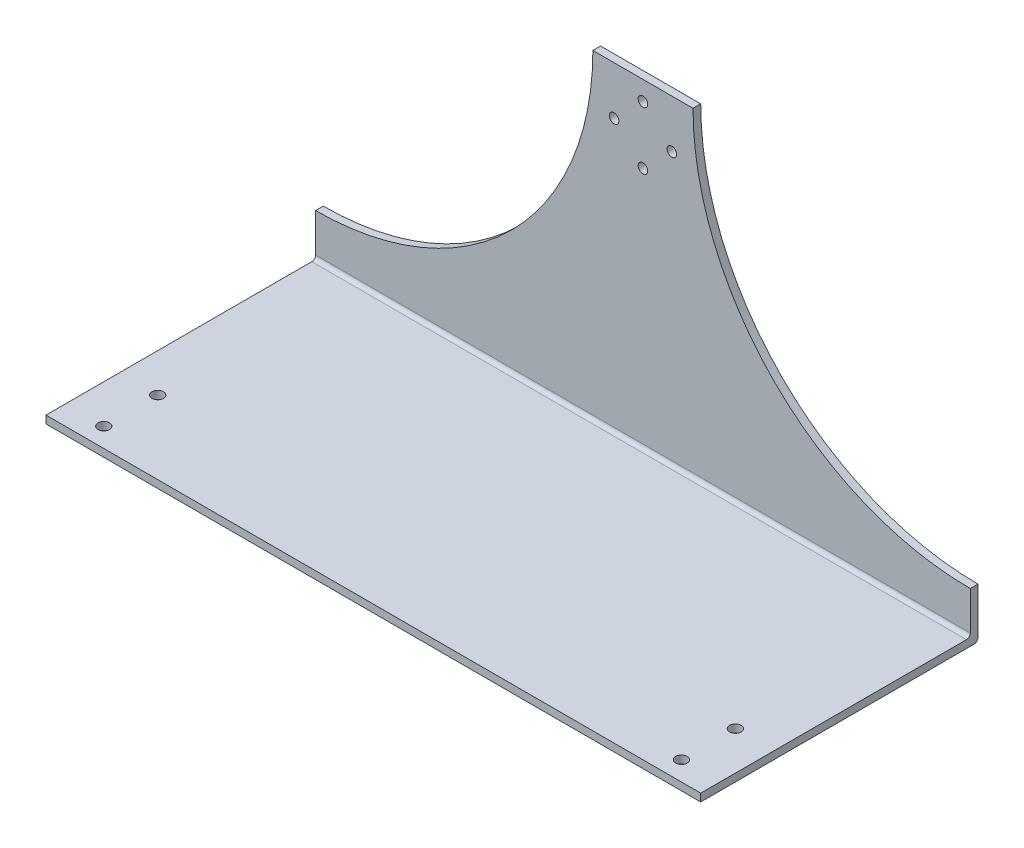
ISO-10303-21;
HEADER;
FILE_DESCRIPTION(('STEP AP214'),'2;1');
FILE_NAME('part.step','',(''),(''),'','','');
FILE_SCHEMA(('AUTOMOTIVE_DESIGN { 1 0 10303 214 1 1 1 1 }'));
ENDSEC;
DATA;
#1=APPLICATION_CONTEXT('core data for automotive mechanical design processes');
#2=APPLICATION_PROTOCOL_DEFINITION('international standard','automotive_design',2000,#1);
#3=PRODUCT_CONTEXT('',#1,'mechanical');
#4=PRODUCT('Part','Part','',(#3));
#5=PRODUCT_RELATED_PRODUCT_CATEGORY('part','',(#4));
#6=PRODUCT_DEFINITION_FORMATION('','',#4);
#7=PRODUCT_DEFINITION_CONTEXT('part definition',#1,'design');
#8=PRODUCT_DEFINITION('design','',#6,#7);
#9=PRODUCT_DEFINITION_SHAPE('','',#8);
#10=(LENGTH_UNIT() NAMED_UNIT(*) SI_UNIT(.MILLI.,.METRE.));
#11=(NAMED_UNIT(*) PLANE_ANGLE_UNIT() SI_UNIT($,.RADIAN.));
#12=(NAMED_UNIT(*) SI_UNIT($,.STERADIAN.) SOLID_ANGLE_UNIT());
#13=UNCERTAINTY_MEASURE_WITH_UNIT(LENGTH_MEASURE(1.E-05),#10,'distance_accuracy_value','');
#14=(GEOMETRIC_REPRESENTATION_CONTEXT(3) GLOBAL_UNCERTAINTY_ASSIGNED_CONTEXT((#13)) GLOBAL_UNIT_ASSIGNED_CONTEXT((#10,
#11,#12)) REPRESENTATION_CONTEXT('',''));
#15=CARTESIAN_POINT('',(0.,0.,0.));
#16=DIRECTION('',(0.,0.,1.));
#17=DIRECTION('',(1.,0.,0.));
#18=AXIS2_PLACEMENT_3D('',#15,#16,#17);
#19=CARTESIAN_POINT('',(0.,0.,1.21678982349346));
#20=DIRECTION('',(0.,0.,1.));
#21=DIRECTION('',(1.,0.,0.));
#22=AXIS2_PLACEMENT_3D('',#19,#20,#21);
#23=PLANE('',#22);
#24=CARTESIAN_POINT('',(6.94229860509075,72.5,1.21678982349346));
#25=DIRECTION('',(0.,0.,1.));
#26=DIRECTION('',(1.,0.,0.));
#27=AXIS2_PLACEMENT_3D('',#24,#25,#26);
#28=CIRCLE('',#27,1.25);
#29=CARTESIAN_POINT('',(8.19229860509076,72.5,1.21678982349346));
#30=VERTEX_POINT('',#29);
#31=EDGE_CURVE('E217',#30,#30,#28,.F.);
#32=ORIENTED_EDGE('',*,*,#31,.T.);
#33=EDGE_LOOP('',(#32));
#34=FACE_BOUND('',#33,.T.);
#35=CARTESIAN_POINT('',(-0.557701394909238,80.,1.21678982349346));
#36=DIRECTION('',(0.,0.,1.));
#37=DIRECTION('',(1.,0.,0.));
#38=AXIS2_PLACEMENT_3D('',#35,#36,#37);
#39=CIRCLE('',#38,1.25);
#40=CARTESIAN_POINT('',(0.692298605090763,80.,1.21678982349346));
#41=VERTEX_POINT('',#40);
#42=EDGE_CURVE('E132',#41,#41,#39,.F.);
#43=ORIENTED_EDGE('',*,*,#42,.T.);
#44=EDGE_LOOP('',(#43));
#45=FACE_BOUND('',#44,.T.);
#46=CARTESIAN_POINT('',(-0.557701394909238,65.,1.21678982349346));
#47=DIRECTION('',(0.,0.,1.));
#48=DIRECTION('',(1.,0.,0.));
#49=AXIS2_PLACEMENT_3D('',#46,#47,#48);
#50=CIRCLE('',#49,1.25);
#51=CARTESIAN_POINT('',(0.692298605090763,65.,1.21678982349346));
#52=VERTEX_POINT('',#51);
#53=EDGE_CURVE('E213',#52,#52,#50,.F.);
#54=ORIENTED_EDGE('',*,*,#53,.T.);
#55=EDGE_LOOP('',(#54));
#56=FACE_BOUND('',#55,.T.);
#57=CARTESIAN_POINT('',(-8.05770139490924,72.5,1.21678982349346));
#58=DIRECTION('',(0.,0.,1.));
#59=DIRECTION('',(1.,0.,0.));
#60=AXIS2_PLACEMENT_3D('',#57,#58,#59);
#61=CIRCLE('',#60,1.25);
#62=CARTESIAN_POINT('',(-6.80770139490924,72.5,1.21678982349346));
#63=VERTEX_POINT('',#62);
#64=EDGE_CURVE('E221',#63,#63,#61,.F.);
#65=ORIENTED_EDGE('',*,*,#64,.T.);
#66=EDGE_LOOP('',(#65));
#67=FACE_BOUND('',#66,.T.);
#68=DIRECTION('',(1.,0.,0.));
#69=VECTOR('',#68,1.);
#70=CARTESIAN_POINT('',(84.4422986050908,85.,1.21678982349346));
#71=LINE('',#70,#69);
#72=CARTESIAN_POINT('',(-13.5577013949092,85.,1.21678982349346));
#73=VERTEX_POINT('',#72);
#74=CARTESIAN_POINT('',(12.4422986050907,85.,1.21678982349346));
#75=VERTEX_POINT('',#74);
#76=EDGE_CURVE('E122',#73,#75,#71,.T.);
#77=ORIENTED_EDGE('',*,*,#76,.F.);
#78=CARTESIAN_POINT('',(-85.5577013949092,85.,1.21678982349346));
#79=DIRECTION('',(0.,0.,1.));
#80=DIRECTION('',(1.,0.,0.));
#81=AXIS2_PLACEMENT_3D('',#78,#79,#80);
#82=CIRCLE('',#81,72.);
#83=CARTESIAN_POINT('',(-85.5577013949092,13.,1.21678982349346));
#84=VERTEX_POINT('',#83);
#85=EDGE_CURVE('E109',#73,#84,#82,.F.);
#86=ORIENTED_EDGE('',*,*,#85,.T.);
#87=DIRECTION('',(0.,1.,0.));
#88=VECTOR('',#87,1.);
#89=CARTESIAN_POINT('',(-85.5577013949092,0.,1.21678982349346));
#90=LINE('',#89,#88);
#91=CARTESIAN_POINT('',(-85.5577013949092,3.,1.21678982349346));
#92=VERTEX_POINT('',#91);
#93=EDGE_CURVE('E119',#92,#84,#90,.T.);
#94=ORIENTED_EDGE('',*,*,#93,.F.);
#95=DIRECTION('',(-1.,0.,0.));
#96=VECTOR('',#95,1.);
#97=CARTESIAN_POINT('',(84.4422986050908,3.,1.21678982349346));
#98=LINE('',#97,#96);
#99=CARTESIAN_POINT('',(84.4422986050908,3.,1.21678982349346));
#100=VERTEX_POINT('',#99);
#101=EDGE_CURVE('E138',#92,#100,#98,.F.);
#102=ORIENTED_EDGE('',*,*,#101,.T.);
#103=DIRECTION('',(0.,-1.,0.));
#104=VECTOR('',#103,1.);
#105=CARTESIAN_POINT('',(84.4422986050908,0.,1.21678982349346));
#106=LINE('',#105,#104);
#107=CARTESIAN_POINT('',(84.4422986050908,13.,1.21678982349346));
#108=VERTEX_POINT('',#107);
#109=EDGE_CURVE('E128',#108,#100,#106,.T.);
#110=ORIENTED_EDGE('',*,*,#109,.F.);
#111=CARTESIAN_POINT('',(84.4422986050908,85.,1.21678982349346));
#112=DIRECTION('',(0.,0.,1.));
#113=DIRECTION('',(1.,0.,0.));
#114=AXIS2_PLACEMENT_3D('',#111,#112,#113);
#115=CIRCLE('',#114,72.0000000000001);
#116=EDGE_CURVE('E227',#108,#75,#115,.F.);
#117=ORIENTED_EDGE('',*,*,#116,.T.);
#118=EDGE_LOOP('',(#77,#86,#94,#102,#110,#117));
#119=FACE_BOUND('',#118,.T.);
#120=ADVANCED_FACE('F33',(#34,#45,#56,#67,#119),#23,.T.);
#121=CARTESIAN_POINT('',(0.,0.,-0.783210176506536));
#122=DIRECTION('',(0.,0.,1.));
#123=DIRECTION('',(1.,0.,0.));
#124=AXIS2_PLACEMENT_3D('',#121,#122,#123);
#125=PLANE('',#124);
#126=CARTESIAN_POINT('',(6.94229860509075,72.5,-0.783210176506536));
#127=DIRECTION('',(0.,0.,1.));
#128=DIRECTION('',(1.,0.,0.));
#129=AXIS2_PLACEMENT_3D('',#126,#127,#128);
#130=CIRCLE('',#129,1.25);
#131=CARTESIAN_POINT('',(8.19229860509076,72.5,-0.783210176506536));
#132=VERTEX_POINT('',#131);
#133=EDGE_CURVE('E220',#132,#132,#130,.F.);
#134=ORIENTED_EDGE('',*,*,#133,.F.);
#135=EDGE_LOOP('',(#134));
#136=FACE_BOUND('',#135,.T.);
#137=CARTESIAN_POINT('',(-0.557701394909238,80.,-0.783210176506536));
#138=DIRECTION('',(0.,0.,1.));
#139=DIRECTION('',(1.,0.,0.));
#140=AXIS2_PLACEMENT_3D('',#137,#138,#139);
#141=CIRCLE('',#140,1.25);
#142=CARTESIAN_POINT('',(0.692298605090763,80.,-0.783210176506536));
#143=VERTEX_POINT('',#142);
#144=EDGE_CURVE('E212',#143,#143,#141,.F.);
#145=ORIENTED_EDGE('',*,*,#144,.F.);
#146=EDGE_LOOP('',(#145));
#147=FACE_BOUND('',#146,.T.);
#148=CARTESIAN_POINT('',(-0.557701394909238,65.,-0.783210176506536));
#149=DIRECTION('',(0.,0.,1.));
#150=DIRECTION('',(1.,0.,0.));
#151=AXIS2_PLACEMENT_3D('',#148,#149,#150);
#152=CIRCLE('',#151,1.25);
#153=CARTESIAN_POINT('',(0.692298605090763,65.,-0.783210176506536));
#154=VERTEX_POINT('',#153);
#155=EDGE_CURVE('E216',#154,#154,#152,.F.);
#156=ORIENTED_EDGE('',*,*,#155,.F.);
#157=EDGE_LOOP('',(#156));
#158=FACE_BOUND('',#157,.T.);
#159=CARTESIAN_POINT('',(-8.05770139490924,72.5,-0.783210176506536));
#160=DIRECTION('',(0.,0.,1.));
#161=DIRECTION('',(1.,0.,0.));
#162=AXIS2_PLACEMENT_3D('',#159,#160,#161);
#163=CIRCLE('',#162,1.25);
#164=CARTESIAN_POINT('',(-6.80770139490924,72.5,-0.783210176506536));
#165=VERTEX_POINT('',#164);
#166=EDGE_CURVE('E224',#165,#165,#163,.F.);
#167=ORIENTED_EDGE('',*,*,#166,.F.);
#168=EDGE_LOOP('',(#167));
#169=FACE_BOUND('',#168,.T.);
#170=CARTESIAN_POINT('',(-85.5577013949092,85.,-0.783210176506536));
#171=DIRECTION('',(0.,0.,1.));
#172=DIRECTION('',(1.,0.,0.));
#173=AXIS2_PLACEMENT_3D('',#170,#171,#172);
#174=CIRCLE('',#173,72.);
#175=CARTESIAN_POINT('',(-13.5577013949092,85.,-0.783210176506536));
#176=VERTEX_POINT('',#175);
#177=CARTESIAN_POINT('',(-85.5577013949092,13.,-0.783210176506536));
#178=VERTEX_POINT('',#177);
#179=EDGE_CURVE('E47',#176,#178,#174,.F.);
#180=ORIENTED_EDGE('',*,*,#179,.F.);
#181=DIRECTION('',(1.,0.,0.));
#182=VECTOR('',#181,1.);
#183=CARTESIAN_POINT('',(84.4422986050908,85.,-0.783210176506536));
#184=LINE('',#183,#182);
#185=CARTESIAN_POINT('',(12.4422986050907,85.,-0.783210176506536));
#186=VERTEX_POINT('',#185);
#187=EDGE_CURVE('E54',#176,#186,#184,.T.);
#188=ORIENTED_EDGE('',*,*,#187,.T.);
#189=CARTESIAN_POINT('',(84.4422986050908,85.,-0.783210176506536));
#190=DIRECTION('',(0.,0.,1.));
#191=DIRECTION('',(1.,0.,0.));
#192=AXIS2_PLACEMENT_3D('',#189,#190,#191);
#193=CIRCLE('',#192,72.0000000000001);
#194=CARTESIAN_POINT('',(84.4422986050908,13.,-0.783210176506536));
#195=VERTEX_POINT('',#194);
#196=EDGE_CURVE('E229',#195,#186,#193,.F.);
#197=ORIENTED_EDGE('',*,*,#196,.F.);
#198=DIRECTION('',(0.,-1.,0.));
#199=VECTOR('',#198,1.);
#200=CARTESIAN_POINT('',(84.4422986050908,0.,-0.783210176506536));
#201=LINE('',#200,#199);
#202=CARTESIAN_POINT('',(84.4422986050908,1.,-0.783210176506536));
#203=VERTEX_POINT('',#202);
#204=EDGE_CURVE('E130',#195,#203,#201,.T.);
#205=ORIENTED_EDGE('',*,*,#204,.T.);
#206=DIRECTION('',(-1.,0.,0.));
#207=VECTOR('',#206,1.);
#208=CARTESIAN_POINT('',(0.,1.,-0.783210176506536));
#209=LINE('',#208,#207);
#210=CARTESIAN_POINT('',(-85.5577013949092,1.,-0.783210176506536));
#211=VERTEX_POINT('',#210);
#212=EDGE_CURVE('E178',#203,#211,#209,.T.);
#213=ORIENTED_EDGE('',*,*,#212,.T.);
#214=DIRECTION('',(0.,1.,0.));
#215=VECTOR('',#214,1.);
#216=CARTESIAN_POINT('',(-85.5577013949092,0.,-0.783210176506536));
#217=LINE('',#216,#215);
#218=EDGE_CURVE('E202',#211,#178,#217,.T.);
#219=ORIENTED_EDGE('',*,*,#218,.T.);
#220=EDGE_LOOP('',(#180,#188,#197,#205,#213,#219));
#221=FACE_BOUND('',#220,.T.);
#222=ADVANCED_FACE('F201',(#136,#147,#158,#169,#221),#125,.F.);
#223=CARTESIAN_POINT('',(84.4422986050908,85.,-0.783210176506536));
#224=DIRECTION('',(0.,-1.,0.));
#225=DIRECTION('',(0.,0.,-1.));
#226=AXIS2_PLACEMENT_3D('',#223,#224,#225);
#227=PLANE('',#226);
#228=DIRECTION('',(0.,0.,-1.));
#229=VECTOR('',#228,1.);
#230=CARTESIAN_POINT('',(-13.5577013949092,85.,13.2167898234935));
#231=LINE('',#230,#229);
#232=EDGE_CURVE('E123',#73,#176,#231,.T.);
#233=ORIENTED_EDGE('',*,*,#232,.F.);
#234=ORIENTED_EDGE('',*,*,#76,.T.);
#235=DIRECTION('',(0.,0.,-1.));
#236=VECTOR('',#235,1.);
#237=CARTESIAN_POINT('',(12.4422986050907,85.,13.2167898234935));
#238=LINE('',#237,#236);
#239=EDGE_CURVE('E41',#186,#75,#238,.F.);
#240=ORIENTED_EDGE('',*,*,#239,.F.);
#241=ORIENTED_EDGE('',*,*,#187,.F.);
#242=EDGE_LOOP('',(#233,#234,#240,#241));
#243=FACE_BOUND('',#242,.T.);
#244=ADVANCED_FACE('F234',(#243),#227,.F.);
#245=CARTESIAN_POINT('',(-85.5577013949092,2.,1.21678982349346));
#246=DIRECTION('',(1.,0.,0.));
#247=DIRECTION('',(0.,0.,-1.));
#248=AXIS2_PLACEMENT_3D('',#245,#246,#247);
#249=PLANE('',#248);
#250=DIRECTION('',(0.,0.,-1.));
#251=VECTOR('',#250,1.);
#252=CARTESIAN_POINT('',(-85.5577013949092,13.,13.2167898234935));
#253=LINE('',#252,#251);
#254=EDGE_CURVE('E11',#178,#84,#253,.F.);
#255=ORIENTED_EDGE('',*,*,#254,.F.);
#256=ORIENTED_EDGE('',*,*,#218,.F.);
#257=CARTESIAN_POINT('',(-85.5577013949092,1.,0.216789823493464));
#258=DIRECTION('',(1.,0.,0.));
#259=DIRECTION('',(0.,0.,-1.));
#260=AXIS2_PLACEMENT_3D('',#257,#258,#259);
#261=CIRCLE('',#260,1.);
#262=CARTESIAN_POINT('',(-85.5577013949092,0.,0.216789823493464));
#263=VERTEX_POINT('',#262);
#264=EDGE_CURVE('E196',#211,#263,#261,.F.);
#265=ORIENTED_EDGE('',*,*,#264,.T.);
#266=DIRECTION('',(0.,0.,1.));
#267=VECTOR('',#266,1.);
#268=CARTESIAN_POINT('',(-85.5577013949092,0.,1.21678982349346));
#269=LINE('',#268,#267);
#270=CARTESIAN_POINT('',(-85.5577013949092,0.,71.2167898234935));
#271=VERTEX_POINT('',#270);
#272=EDGE_CURVE('E161',#263,#271,#269,.T.);
#273=ORIENTED_EDGE('',*,*,#272,.T.);
#274=DIRECTION('',(0.,-1.,0.));
#275=VECTOR('',#274,1.);
#276=CARTESIAN_POINT('',(-85.5577013949092,2.,71.2167898234935));
#277=LINE('',#276,#275);
#278=CARTESIAN_POINT('',(-85.5577013949092,2.,71.2167898234935));
#279=VERTEX_POINT('',#278);
#280=EDGE_CURVE('E175',#279,#271,#277,.T.);
#281=ORIENTED_EDGE('',*,*,#280,.F.);
#282=DIRECTION('',(0.,0.,1.));
#283=VECTOR('',#282,1.);
#284=CARTESIAN_POINT('',(-85.5577013949092,2.,1.21678982349346));
#285=LINE('',#284,#283);
#286=CARTESIAN_POINT('',(-85.5577013949092,2.,2.21678982349346));
#287=VERTEX_POINT('',#286);
#288=EDGE_CURVE('E165',#287,#279,#285,.T.);
#289=ORIENTED_EDGE('',*,*,#288,.F.);
#290=CARTESIAN_POINT('',(-85.5577013949092,3.,2.21678982349346));
#291=DIRECTION('',(1.,0.,0.));
#292=DIRECTION('',(0.,0.,-1.));
#293=AXIS2_PLACEMENT_3D('',#290,#291,#292);
#294=CIRCLE('',#293,1.);
#295=EDGE_CURVE('E127',#287,#92,#294,.T.);
#296=ORIENTED_EDGE('',*,*,#295,.T.);
#297=ORIENTED_EDGE('',*,*,#93,.T.);
#298=EDGE_LOOP('',(#255,#256,#265,#273,#281,#289,#296,#297));
#299=FACE_BOUND('',#298,.T.);
#300=ADVANCED_FACE('F125',(#299),#249,.F.);
#301=CARTESIAN_POINT('',(84.4422986050908,2.,1.21678982349346));
#302=DIRECTION('',(-1.,0.,0.));
#303=DIRECTION('',(0.,0.,1.));
#304=AXIS2_PLACEMENT_3D('',#301,#302,#303);
#305=PLANE('',#304);
#306=DIRECTION('',(0.,0.,-1.));
#307=VECTOR('',#306,1.);
#308=CARTESIAN_POINT('',(84.4422986050908,13.,13.2167898234935));
#309=LINE('',#308,#307);
#310=EDGE_CURVE('E225',#108,#195,#309,.T.);
#311=ORIENTED_EDGE('',*,*,#310,.F.);
#312=ORIENTED_EDGE('',*,*,#109,.T.);
#313=CARTESIAN_POINT('',(84.4422986050908,3.,2.21678982349346));
#314=DIRECTION('',(-1.,0.,0.));
#315=DIRECTION('',(0.,0.,1.));
#316=AXIS2_PLACEMENT_3D('',#313,#314,#315);
#317=CIRCLE('',#316,1.);
#318=CARTESIAN_POINT('',(84.4422986050908,2.,2.21678982349346));
#319=VERTEX_POINT('',#318);
#320=EDGE_CURVE('E237',#100,#319,#317,.T.);
#321=ORIENTED_EDGE('',*,*,#320,.T.);
#322=DIRECTION('',(0.,0.,-1.));
#323=VECTOR('',#322,1.);
#324=CARTESIAN_POINT('',(84.4422986050908,2.,1.21678982349346));
#325=LINE('',#324,#323);
#326=CARTESIAN_POINT('',(84.4422986050908,2.,71.2167898234935));
#327=VERTEX_POINT('',#326);
#328=EDGE_CURVE('E164',#327,#319,#325,.T.);
#329=ORIENTED_EDGE('',*,*,#328,.F.);
#330=DIRECTION('',(0.,-1.,0.));
#331=VECTOR('',#330,1.);
#332=CARTESIAN_POINT('',(84.4422986050908,2.,71.2167898234935));
#333=LINE('',#332,#331);
#334=CARTESIAN_POINT('',(84.4422986050908,0.,71.2167898234935));
#335=VERTEX_POINT('',#334);
#336=EDGE_CURVE('E172',#327,#335,#333,.T.);
#337=ORIENTED_EDGE('',*,*,#336,.T.);
#338=DIRECTION('',(0.,0.,-1.));
#339=VECTOR('',#338,1.);
#340=CARTESIAN_POINT('',(84.4422986050908,0.,1.21678982349346));
#341=LINE('',#340,#339);
#342=CARTESIAN_POINT('',(84.4422986050908,0.,0.216789823493464));
#343=VERTEX_POINT('',#342);
#344=EDGE_CURVE('E169',#335,#343,#341,.T.);
#345=ORIENTED_EDGE('',*,*,#344,.T.);
#346=CARTESIAN_POINT('',(84.4422986050908,1.,0.216789823493464));
#347=DIRECTION('',(-1.,0.,0.));
#348=DIRECTION('',(0.,0.,1.));
#349=AXIS2_PLACEMENT_3D('',#346,#347,#348);
#350=CIRCLE('',#349,1.);
#351=EDGE_CURVE('E191',#343,#203,#350,.F.);
#352=ORIENTED_EDGE('',*,*,#351,.T.);
#353=ORIENTED_EDGE('',*,*,#204,.F.);
#354=EDGE_LOOP('',(#311,#312,#321,#329,#337,#345,#352,#353));
#355=FACE_BOUND('',#354,.T.);
#356=ADVANCED_FACE('F267',(#355),#305,.F.);
#357=CARTESIAN_POINT('',(0.,2.,0.));
#358=DIRECTION('',(0.,1.,0.));
#359=DIRECTION('',(0.,0.,1.));
#360=AXIS2_PLACEMENT_3D('',#357,#358,#359);
#361=PLANE('',#360);
#362=CARTESIAN_POINT('',(74.4422986050907,2.,52.2167898234935));
#363=DIRECTION('',(0.,1.,0.));
#364=DIRECTION('',(0.,0.,1.));
#365=AXIS2_PLACEMENT_3D('',#362,#363,#364);
#366=CIRCLE('',#365,1.5);
#367=CARTESIAN_POINT('',(74.4422986050907,2.,53.7167898234935));
#368=VERTEX_POINT('',#367);
#369=EDGE_CURVE('E150',#368,#368,#366,.F.);
#370=ORIENTED_EDGE('',*,*,#369,.T.);
#371=EDGE_LOOP('',(#370));
#372=FACE_BOUND('',#371,.T.);
#373=CARTESIAN_POINT('',(-75.5577013949092,2.,52.2167898234935));
#374=DIRECTION('',(0.,1.,0.));
#375=DIRECTION('',(0.,0.,1.));
#376=AXIS2_PLACEMENT_3D('',#373,#374,#375);
#377=CIRCLE('',#376,1.5);
#378=CARTESIAN_POINT('',(-75.5577013949092,2.,53.7167898234935));
#379=VERTEX_POINT('',#378);
#380=EDGE_CURVE('E158',#379,#379,#377,.F.);
#381=ORIENTED_EDGE('',*,*,#380,.T.);
#382=EDGE_LOOP('',(#381));
#383=FACE_BOUND('',#382,.T.);
#384=ORIENTED_EDGE('',*,*,#328,.T.);
#385=DIRECTION('',(-1.,0.,0.));
#386=VECTOR('',#385,1.);
#387=CARTESIAN_POINT('',(-85.5577013949092,2.,2.21678982349346));
#388=LINE('',#387,#386);
#389=EDGE_CURVE('E136',#319,#287,#388,.T.);
#390=ORIENTED_EDGE('',*,*,#389,.T.);
#391=ORIENTED_EDGE('',*,*,#288,.T.);
#392=DIRECTION('',(1.,0.,0.));
#393=VECTOR('',#392,1.);
#394=CARTESIAN_POINT('',(-85.5577013949092,2.,71.2167898234935));
#395=LINE('',#394,#393);
#396=EDGE_CURVE('E162',#279,#327,#395,.T.);
#397=ORIENTED_EDGE('',*,*,#396,.T.);
#398=EDGE_LOOP('',(#384,#390,#391,#397));
#399=FACE_BOUND('',#398,.T.);
#400=CARTESIAN_POINT('',(-75.5577013949092,2.,66.2167898234935));
#401=DIRECTION('',(0.,1.,0.));
#402=DIRECTION('',(0.,0.,1.));
#403=AXIS2_PLACEMENT_3D('',#400,#401,#402);
#404=CIRCLE('',#403,1.5);
#405=CARTESIAN_POINT('',(-75.5577013949092,2.,67.7167898234935));
#406=VERTEX_POINT('',#405);
#407=EDGE_CURVE('E154',#406,#406,#404,.F.);
#408=ORIENTED_EDGE('',*,*,#407,.T.);
#409=EDGE_LOOP('',(#408));
#410=FACE_BOUND('',#409,.T.);
#411=CARTESIAN_POINT('',(74.4422986050907,2.,66.2167898234935));
#412=DIRECTION('',(0.,1.,0.));
#413=DIRECTION('',(0.,0.,1.));
#414=AXIS2_PLACEMENT_3D('',#411,#412,#413);
#415=CIRCLE('',#414,1.5);
#416=CARTESIAN_POINT('',(74.4422986050907,2.,67.7167898234935));
#417=VERTEX_POINT('',#416);
#418=EDGE_CURVE('E145',#417,#417,#415,.F.);
#419=ORIENTED_EDGE('',*,*,#418,.T.);
#420=EDGE_LOOP('',(#419));
#421=FACE_BOUND('',#420,.T.);
#422=ADVANCED_FACE('F254',(#372,#383,#399,#410,#421),#361,.T.);
#423=CARTESIAN_POINT('',(0.,0.,0.));
#424=DIRECTION('',(0.,1.,0.));
#425=DIRECTION('',(0.,0.,1.));
#426=AXIS2_PLACEMENT_3D('',#423,#424,#425);
#427=PLANE('',#426);
#428=CARTESIAN_POINT('',(74.4422986050907,0.,52.2167898234935));
#429=DIRECTION('',(0.,1.,0.));
#430=DIRECTION('',(0.,0.,1.));
#431=AXIS2_PLACEMENT_3D('',#428,#429,#430);
#432=CIRCLE('',#431,1.5);
#433=CARTESIAN_POINT('',(74.4422986050907,0.,53.7167898234935));
#434=VERTEX_POINT('',#433);
#435=EDGE_CURVE('E148',#434,#434,#432,.F.);
#436=ORIENTED_EDGE('',*,*,#435,.F.);
#437=EDGE_LOOP('',(#436));
#438=FACE_BOUND('',#437,.T.);
#439=CARTESIAN_POINT('',(-75.5577013949092,0.,52.2167898234935));
#440=DIRECTION('',(0.,1.,0.));
#441=DIRECTION('',(0.,0.,1.));
#442=AXIS2_PLACEMENT_3D('',#439,#440,#441);
#443=CIRCLE('',#442,1.5);
#444=CARTESIAN_POINT('',(-75.5577013949092,0.,53.7167898234935));
#445=VERTEX_POINT('',#444);
#446=EDGE_CURVE('E157',#445,#445,#443,.F.);
#447=ORIENTED_EDGE('',*,*,#446,.F.);
#448=EDGE_LOOP('',(#447));
#449=FACE_BOUND('',#448,.T.);
#450=ORIENTED_EDGE('',*,*,#272,.F.);
#451=DIRECTION('',(-1.,0.,0.));
#452=VECTOR('',#451,1.);
#453=CARTESIAN_POINT('',(0.,0.,0.216789823493464));
#454=LINE('',#453,#452);
#455=EDGE_CURVE('E194',#263,#343,#454,.F.);
#456=ORIENTED_EDGE('',*,*,#455,.T.);
#457=ORIENTED_EDGE('',*,*,#344,.F.);
#458=DIRECTION('',(1.,0.,0.));
#459=VECTOR('',#458,1.);
#460=CARTESIAN_POINT('',(-85.5577013949092,0.,71.2167898234935));
#461=LINE('',#460,#459);
#462=EDGE_CURVE('E167',#271,#335,#461,.T.);
#463=ORIENTED_EDGE('',*,*,#462,.F.);
#464=EDGE_LOOP('',(#450,#456,#457,#463));
#465=FACE_BOUND('',#464,.T.);
#466=CARTESIAN_POINT('',(-75.5577013949092,0.,66.2167898234935));
#467=DIRECTION('',(0.,1.,0.));
#468=DIRECTION('',(0.,0.,1.));
#469=AXIS2_PLACEMENT_3D('',#466,#467,#468);
#470=CIRCLE('',#469,1.5);
#471=CARTESIAN_POINT('',(-75.5577013949092,0.,67.7167898234935));
#472=VERTEX_POINT('',#471);
#473=EDGE_CURVE('E153',#472,#472,#470,.F.);
#474=ORIENTED_EDGE('',*,*,#473,.F.);
#475=EDGE_LOOP('',(#474));
#476=FACE_BOUND('',#475,.T.);
#477=CARTESIAN_POINT('',(74.4422986050907,0.,66.2167898234935));
#478=DIRECTION('',(0.,1.,0.));
#479=DIRECTION('',(0.,0.,1.));
#480=AXIS2_PLACEMENT_3D('',#477,#478,#479);
#481=CIRCLE('',#480,1.5);
#482=CARTESIAN_POINT('',(74.4422986050907,0.,67.7167898234935));
#483=VERTEX_POINT('',#482);
#484=EDGE_CURVE('E149',#483,#483,#481,.F.);
#485=ORIENTED_EDGE('',*,*,#484,.F.);
#486=EDGE_LOOP('',(#485));
#487=FACE_BOUND('',#486,.T.);
#488=ADVANCED_FACE('F310',(#438,#449,#465,#476,#487),#427,.F.);
#489=CARTESIAN_POINT('',(-85.5577013949092,2.,71.2167898234935));
#490=DIRECTION('',(0.,0.,-1.));
#491=DIRECTION('',(-1.,0.,0.));
#492=AXIS2_PLACEMENT_3D('',#489,#490,#491);
#493=PLANE('',#492);
#494=ORIENTED_EDGE('',*,*,#462,.T.);
#495=ORIENTED_EDGE('',*,*,#336,.F.);
#496=ORIENTED_EDGE('',*,*,#396,.F.);
#497=ORIENTED_EDGE('',*,*,#280,.T.);
#498=EDGE_LOOP('',(#494,#495,#496,#497));
#499=FACE_BOUND('',#498,.T.);
#500=ADVANCED_FACE('F262',(#499),#493,.F.);
#501=CARTESIAN_POINT('',(-75.5577013949092,24.,52.2167898234935));
#502=DIRECTION('',(0.,-1.,0.));
#503=DIRECTION('',(0.,0.,-1.));
#504=AXIS2_PLACEMENT_3D('',#501,#502,#503);
#505=CYLINDRICAL_SURFACE('',#504,1.5);
#506=ORIENTED_EDGE('',*,*,#380,.F.);
#507=EDGE_LOOP('',(#506));
#508=FACE_BOUND('',#507,.T.);
#509=ORIENTED_EDGE('',*,*,#446,.T.);
#510=EDGE_LOOP('',(#509));
#511=FACE_BOUND('',#510,.T.);
#512=ADVANCED_FACE('F303',(#508,#511),#505,.F.);
#513=CARTESIAN_POINT('',(-75.5577013949092,24.,66.2167898234935));
#514=DIRECTION('',(0.,-1.,0.));
#515=DIRECTION('',(0.,0.,-1.));
#516=AXIS2_PLACEMENT_3D('',#513,#514,#515);
#517=CYLINDRICAL_SURFACE('',#516,1.5);
#518=ORIENTED_EDGE('',*,*,#407,.F.);
#519=EDGE_LOOP('',(#518));
#520=FACE_BOUND('',#519,.T.);
#521=ORIENTED_EDGE('',*,*,#473,.T.);
#522=EDGE_LOOP('',(#521));
#523=FACE_BOUND('',#522,.T.);
#524=ADVANCED_FACE('F299',(#520,#523),#517,.F.);
#525=CARTESIAN_POINT('',(74.4422986050907,24.,52.2167898234935));
#526=DIRECTION('',(0.,-1.,0.));
#527=DIRECTION('',(0.,0.,-1.));
#528=AXIS2_PLACEMENT_3D('',#525,#526,#527);
#529=CYLINDRICAL_SURFACE('',#528,1.5);
#530=ORIENTED_EDGE('',*,*,#369,.F.);
#531=EDGE_LOOP('',(#530));
#532=FACE_BOUND('',#531,.T.);
#533=ORIENTED_EDGE('',*,*,#435,.T.);
#534=EDGE_LOOP('',(#533));
#535=FACE_BOUND('',#534,.T.);
#536=ADVANCED_FACE('F295',(#532,#535),#529,.F.);
#537=CARTESIAN_POINT('',(74.4422986050907,24.,66.2167898234935));
#538=DIRECTION('',(0.,-1.,0.));
#539=DIRECTION('',(0.,0.,-1.));
#540=AXIS2_PLACEMENT_3D('',#537,#538,#539);
#541=CYLINDRICAL_SURFACE('',#540,1.5);
#542=ORIENTED_EDGE('',*,*,#418,.F.);
#543=EDGE_LOOP('',(#542));
#544=FACE_BOUND('',#543,.T.);
#545=ORIENTED_EDGE('',*,*,#484,.T.);
#546=EDGE_LOOP('',(#545));
#547=FACE_BOUND('',#546,.T.);
#548=ADVANCED_FACE('F279',(#544,#547),#541,.F.);
#549=CARTESIAN_POINT('',(0.,1.,0.216789823493464));
#550=DIRECTION('',(-1.,0.,0.));
#551=DIRECTION('',(0.,0.,1.));
#552=AXIS2_PLACEMENT_3D('',#549,#550,#551);
#553=CYLINDRICAL_SURFACE('',#552,1.);
#554=ORIENTED_EDGE('',*,*,#351,.F.);
#555=ORIENTED_EDGE('',*,*,#455,.F.);
#556=ORIENTED_EDGE('',*,*,#264,.F.);
#557=ORIENTED_EDGE('',*,*,#212,.F.);
#558=EDGE_LOOP('',(#554,#555,#556,#557));
#559=FACE_BOUND('',#558,.T.);
#560=ADVANCED_FACE('F270',(#559),#553,.T.);
#561=CARTESIAN_POINT('',(0.,3.,2.21678982349346));
#562=DIRECTION('',(1.,0.,0.));
#563=DIRECTION('',(0.,0.,-1.));
#564=AXIS2_PLACEMENT_3D('',#561,#562,#563);
#565=CYLINDRICAL_SURFACE('',#564,1.);
#566=ORIENTED_EDGE('',*,*,#320,.F.);
#567=ORIENTED_EDGE('',*,*,#101,.F.);
#568=ORIENTED_EDGE('',*,*,#295,.F.);
#569=ORIENTED_EDGE('',*,*,#389,.F.);
#570=EDGE_LOOP('',(#566,#567,#568,#569));
#571=FACE_BOUND('',#570,.T.);
#572=ADVANCED_FACE('F35',(#571),#565,.F.);
#573=CARTESIAN_POINT('',(-0.557701394909238,80.,13.2167898234935));
#574=DIRECTION('',(0.,0.,-1.));
#575=DIRECTION('',(-1.,0.,0.));
#576=AXIS2_PLACEMENT_3D('',#573,#574,#575);
#577=CYLINDRICAL_SURFACE('',#576,1.25);
#578=ORIENTED_EDGE('',*,*,#42,.F.);
#579=EDGE_LOOP('',(#578));
#580=FACE_BOUND('',#579,.T.);
#581=ORIENTED_EDGE('',*,*,#144,.T.);
#582=EDGE_LOOP('',(#581));
#583=FACE_BOUND('',#582,.T.);
#584=ADVANCED_FACE('F269',(#580,#583),#577,.F.);
#585=CARTESIAN_POINT('',(-0.557701394909238,65.,13.2167898234935));
#586=DIRECTION('',(0.,0.,-1.));
#587=DIRECTION('',(-1.,0.,0.));
#588=AXIS2_PLACEMENT_3D('',#585,#586,#587);
#589=CYLINDRICAL_SURFACE('',#588,1.25);
#590=ORIENTED_EDGE('',*,*,#53,.F.);
#591=EDGE_LOOP('',(#590));
#592=FACE_BOUND('',#591,.T.);
#593=ORIENTED_EDGE('',*,*,#155,.T.);
#594=EDGE_LOOP('',(#593));
#595=FACE_BOUND('',#594,.T.);
#596=ADVANCED_FACE('F276',(#592,#595),#589,.F.);
#597=CARTESIAN_POINT('',(6.94229860509075,72.5,13.2167898234935));
#598=DIRECTION('',(0.,0.,-1.));
#599=DIRECTION('',(-1.,0.,0.));
#600=AXIS2_PLACEMENT_3D('',#597,#598,#599);
#601=CYLINDRICAL_SURFACE('',#600,1.25);
#602=ORIENTED_EDGE('',*,*,#31,.F.);
#603=EDGE_LOOP('',(#602));
#604=FACE_BOUND('',#603,.T.);
#605=ORIENTED_EDGE('',*,*,#133,.T.);
#606=EDGE_LOOP('',(#605));
#607=FACE_BOUND('',#606,.T.);
#608=ADVANCED_FACE('F355',(#604,#607),#601,.F.);
#609=CARTESIAN_POINT('',(-8.05770139490924,72.5,13.2167898234935));
#610=DIRECTION('',(0.,0.,-1.));
#611=DIRECTION('',(-1.,0.,0.));
#612=AXIS2_PLACEMENT_3D('',#609,#610,#611);
#613=CYLINDRICAL_SURFACE('',#612,1.25);
#614=ORIENTED_EDGE('',*,*,#64,.F.);
#615=EDGE_LOOP('',(#614));
#616=FACE_BOUND('',#615,.T.);
#617=ORIENTED_EDGE('',*,*,#166,.T.);
#618=EDGE_LOOP('',(#617));
#619=FACE_BOUND('',#618,.T.);
#620=ADVANCED_FACE('F339',(#616,#619),#613,.F.);
#621=CARTESIAN_POINT('',(84.4422986050908,85.,13.2167898234935));
#622=DIRECTION('',(0.,0.,-1.));
#623=DIRECTION('',(-1.,0.,0.));
#624=AXIS2_PLACEMENT_3D('',#621,#622,#623);
#625=CYLINDRICAL_SURFACE('',#624,72.0000000000001);
#626=ORIENTED_EDGE('',*,*,#310,.T.);
#627=ORIENTED_EDGE('',*,*,#196,.T.);
#628=ORIENTED_EDGE('',*,*,#239,.T.);
#629=ORIENTED_EDGE('',*,*,#116,.F.);
#630=EDGE_LOOP('',(#626,#627,#628,#629));
#631=FACE_BOUND('',#630,.T.);
#632=ADVANCED_FACE('F334',(#631),#625,.F.);
#633=CARTESIAN_POINT('',(-85.5577013949092,85.,13.2167898234935));
#634=DIRECTION('',(0.,0.,-1.));
#635=DIRECTION('',(-1.,0.,0.));
#636=AXIS2_PLACEMENT_3D('',#633,#634,#635);
#637=CYLINDRICAL_SURFACE('',#636,72.);
#638=ORIENTED_EDGE('',*,*,#232,.T.);
#639=ORIENTED_EDGE('',*,*,#179,.T.);
#640=ORIENTED_EDGE('',*,*,#254,.T.);
#641=ORIENTED_EDGE('',*,*,#85,.F.);
#642=EDGE_LOOP('',(#638,#639,#640,#641));
#643=FACE_BOUND('',#642,.T.);
#644=ADVANCED_FACE('F108',(#643),#637,.F.);
#645=CLOSED_SHELL('',(#120,#222,#244,#300,#356,#422,#488,#500,#512,#524,#536,#548,#560,#572,
#584,#596,#608,#620,#632,#644));
#646=MANIFOLD_SOLID_BREP('B2',#645);
#647=ADVANCED_BREP_SHAPE_REPRESENTATION('',(#18,#646),#14);
#648=SHAPE_DEFINITION_REPRESENTATION(#9,#647);
ENDSEC;
END-ISO-10303-21;
